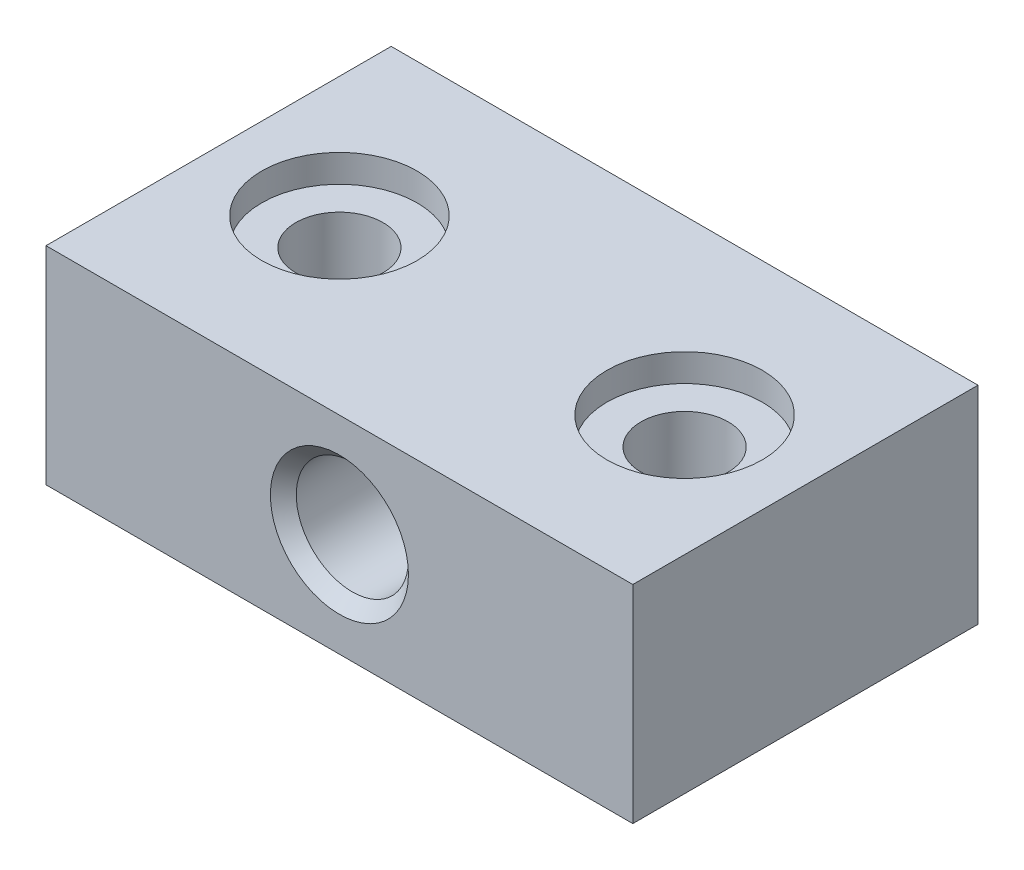
ISO-10303-21;
HEADER;
FILE_DESCRIPTION(('STEP AP214'),'2;1');
FILE_NAME('part.step','',(''),(''),'','','');
FILE_SCHEMA(('AUTOMOTIVE_DESIGN { 1 0 10303 214 1 1 1 1 }'));
ENDSEC;
DATA;
#1=APPLICATION_CONTEXT('core data for automotive mechanical design processes');
#2=APPLICATION_PROTOCOL_DEFINITION('international standard','automotive_design',2000,#1);
#3=PRODUCT_CONTEXT('',#1,'mechanical');
#4=PRODUCT('Part','Part','',(#3));
#5=PRODUCT_RELATED_PRODUCT_CATEGORY('part','',(#4));
#6=PRODUCT_DEFINITION_FORMATION('','',#4);
#7=PRODUCT_DEFINITION_CONTEXT('part definition',#1,'design');
#8=PRODUCT_DEFINITION('design','',#6,#7);
#9=PRODUCT_DEFINITION_SHAPE('','',#8);
#10=(LENGTH_UNIT() NAMED_UNIT(*) SI_UNIT(.MILLI.,.METRE.));
#11=(NAMED_UNIT(*) PLANE_ANGLE_UNIT() SI_UNIT($,.RADIAN.));
#12=(NAMED_UNIT(*) SI_UNIT($,.STERADIAN.) SOLID_ANGLE_UNIT());
#13=UNCERTAINTY_MEASURE_WITH_UNIT(LENGTH_MEASURE(1.E-05),#10,'distance_accuracy_value','');
#14=(GEOMETRIC_REPRESENTATION_CONTEXT(3) GLOBAL_UNCERTAINTY_ASSIGNED_CONTEXT((#13)) GLOBAL_UNIT_ASSIGNED_CONTEXT((#10,
#11,#12)) REPRESENTATION_CONTEXT('',''));
#15=CARTESIAN_POINT('',(0.,0.,0.));
#16=DIRECTION('',(0.,0.,1.));
#17=DIRECTION('',(1.,0.,0.));
#18=AXIS2_PLACEMENT_3D('',#15,#16,#17);
#19=CARTESIAN_POINT('',(-10.,-14.,-10.));
#20=DIRECTION('',(0.,1.,0.));
#21=DIRECTION('',(0.,0.,1.));
#22=AXIS2_PLACEMENT_3D('',#19,#20,#21);
#23=CYLINDRICAL_SURFACE('',#22,2.525);
#24=CARTESIAN_POINT('',(-10.,4.4,-10.));
#25=DIRECTION('',(0.,1.,0.));
#26=DIRECTION('',(0.,0.,1.));
#27=AXIS2_PLACEMENT_3D('',#24,#25,#26);
#28=CIRCLE('',#27,2.525);
#29=CARTESIAN_POINT('',(-10.,4.4,-7.475));
#30=VERTEX_POINT('',#29);
#31=EDGE_CURVE('E252',#30,#30,#28,.F.);
#32=ORIENTED_EDGE('',*,*,#31,.F.);
#33=EDGE_LOOP('',(#32));
#34=FACE_BOUND('',#33,.T.);
#35=CARTESIAN_POINT('',(-10.,-1.03,-10.));
#36=DIRECTION('',(0.,-1.,0.));
#37=DIRECTION('',(0.,0.,-1.));
#38=AXIS2_PLACEMENT_3D('',#35,#36,#37);
#39=CIRCLE('',#38,2.525);
#40=CARTESIAN_POINT('',(-10.,-1.03,-12.525));
#41=VERTEX_POINT('',#40);
#42=EDGE_CURVE('E194',#41,#41,#39,.F.);
#43=ORIENTED_EDGE('',*,*,#42,.F.);
#44=EDGE_LOOP('',(#43));
#45=FACE_BOUND('',#44,.T.);
#46=ADVANCED_FACE('F33',(#34,#45),#23,.F.);
#47=CARTESIAN_POINT('',(10.,-14.,-10.));
#48=DIRECTION('',(0.,1.,0.));
#49=DIRECTION('',(0.,0.,1.));
#50=AXIS2_PLACEMENT_3D('',#47,#48,#49);
#51=CYLINDRICAL_SURFACE('',#50,2.525);
#52=CARTESIAN_POINT('',(10.,4.4,-10.));
#53=DIRECTION('',(0.,1.,0.));
#54=DIRECTION('',(0.,0.,1.));
#55=AXIS2_PLACEMENT_3D('',#52,#53,#54);
#56=CIRCLE('',#55,2.525);
#57=CARTESIAN_POINT('',(10.,4.4,-7.475));
#58=VERTEX_POINT('',#57);
#59=EDGE_CURVE('E259',#58,#58,#56,.F.);
#60=ORIENTED_EDGE('',*,*,#59,.F.);
#61=EDGE_LOOP('',(#60));
#62=FACE_BOUND('',#61,.T.);
#63=CARTESIAN_POINT('',(10.,-1.03,-10.));
#64=DIRECTION('',(0.,-1.,0.));
#65=DIRECTION('',(0.,0.,-1.));
#66=AXIS2_PLACEMENT_3D('',#63,#64,#65);
#67=CIRCLE('',#66,2.525);
#68=CARTESIAN_POINT('',(10.,-1.03,-12.525));
#69=VERTEX_POINT('',#68);
#70=EDGE_CURVE('E239',#69,#69,#67,.F.);
#71=ORIENTED_EDGE('',*,*,#70,.F.);
#72=EDGE_LOOP('',(#71));
#73=FACE_BOUND('',#72,.T.);
#74=ADVANCED_FACE('F323',(#62,#73),#51,.F.);
#75=CARTESIAN_POINT('',(17.,6.,-20.));
#76=DIRECTION('',(1.,0.,0.));
#77=DIRECTION('',(0.,0.,-1.));
#78=AXIS2_PLACEMENT_3D('',#75,#76,#77);
#79=PLANE('',#78);
#80=DIRECTION('',(0.,1.,0.));
#81=VECTOR('',#80,1.);
#82=CARTESIAN_POINT('',(17.,6.,0.));
#83=LINE('',#82,#81);
#84=CARTESIAN_POINT('',(17.,-6.,0.));
#85=VERTEX_POINT('',#84);
#86=CARTESIAN_POINT('',(17.,6.,0.));
#87=VERTEX_POINT('',#86);
#88=EDGE_CURVE('E277',#85,#87,#83,.T.);
#89=ORIENTED_EDGE('',*,*,#88,.F.);
#90=DIRECTION('',(0.,0.,1.));
#91=VECTOR('',#90,1.);
#92=CARTESIAN_POINT('',(17.,-6.,-20.));
#93=LINE('',#92,#91);
#94=CARTESIAN_POINT('',(17.,-6.,-20.));
#95=VERTEX_POINT('',#94);
#96=EDGE_CURVE('E288',#95,#85,#93,.T.);
#97=ORIENTED_EDGE('',*,*,#96,.F.);
#98=DIRECTION('',(0.,1.,0.));
#99=VECTOR('',#98,1.);
#100=CARTESIAN_POINT('',(17.,6.,-20.));
#101=LINE('',#100,#99);
#102=CARTESIAN_POINT('',(17.,6.,-20.));
#103=VERTEX_POINT('',#102);
#104=EDGE_CURVE('E263',#95,#103,#101,.T.);
#105=ORIENTED_EDGE('',*,*,#104,.T.);
#106=DIRECTION('',(0.,0.,1.));
#107=VECTOR('',#106,1.);
#108=CARTESIAN_POINT('',(17.,6.,-20.));
#109=LINE('',#108,#107);
#110=EDGE_CURVE('E276',#103,#87,#109,.T.);
#111=ORIENTED_EDGE('',*,*,#110,.T.);
#112=EDGE_LOOP('',(#89,#97,#105,#111));
#113=FACE_BOUND('',#112,.T.);
#114=ADVANCED_FACE('F329',(#113),#79,.T.);
#115=CARTESIAN_POINT('',(-17.,-6.,-20.));
#116=DIRECTION('',(0.,-1.,0.));
#117=DIRECTION('',(0.,0.,-1.));
#118=AXIS2_PLACEMENT_3D('',#115,#116,#117);
#119=PLANE('',#118);
#120=DIRECTION('',(-0.866025403784439,0.,0.5));
#121=VECTOR('',#120,1.);
#122=CARTESIAN_POINT('',(-5.99896263451589,-6.,-7.69));
#123=LINE('',#122,#121);
#124=CARTESIAN_POINT('',(-5.99896263451589,-6.,-7.69));
#125=VERTEX_POINT('',#124);
#126=CARTESIAN_POINT('',(-10.,-6.,-5.38));
#127=VERTEX_POINT('',#126);
#128=EDGE_CURVE('E48',#125,#127,#123,.T.);
#129=ORIENTED_EDGE('',*,*,#128,.F.);
#130=DIRECTION('',(0.,0.,1.));
#131=VECTOR('',#130,1.);
#132=CARTESIAN_POINT('',(-5.99896263451589,-6.,-12.31));
#133=LINE('',#132,#131);
#134=CARTESIAN_POINT('',(-5.99896263451589,-6.,-12.31));
#135=VERTEX_POINT('',#134);
#136=EDGE_CURVE('E168',#135,#125,#133,.T.);
#137=ORIENTED_EDGE('',*,*,#136,.F.);
#138=DIRECTION('',(0.866025403784439,0.,0.5));
#139=VECTOR('',#138,1.);
#140=CARTESIAN_POINT('',(-10.,-6.,-14.62));
#141=LINE('',#140,#139);
#142=CARTESIAN_POINT('',(-10.,-6.,-14.62));
#143=VERTEX_POINT('',#142);
#144=EDGE_CURVE('E171',#143,#135,#141,.T.);
#145=ORIENTED_EDGE('',*,*,#144,.F.);
#146=DIRECTION('',(0.866025403784439,0.,-0.5));
#147=VECTOR('',#146,1.);
#148=CARTESIAN_POINT('',(-14.0010373654841,-6.,-12.31));
#149=LINE('',#148,#147);
#150=CARTESIAN_POINT('',(-14.0010373654841,-6.,-12.31));
#151=VERTEX_POINT('',#150);
#152=EDGE_CURVE('E187',#151,#143,#149,.T.);
#153=ORIENTED_EDGE('',*,*,#152,.F.);
#154=DIRECTION('',(0.,0.,-1.));
#155=VECTOR('',#154,1.);
#156=CARTESIAN_POINT('',(-14.0010373654841,-6.,-7.69));
#157=LINE('',#156,#155);
#158=CARTESIAN_POINT('',(-14.0010373654841,-6.,-7.69));
#159=VERTEX_POINT('',#158);
#160=EDGE_CURVE('E184',#159,#151,#157,.T.);
#161=ORIENTED_EDGE('',*,*,#160,.F.);
#162=DIRECTION('',(-0.866025403784439,0.,-0.5));
#163=VECTOR('',#162,1.);
#164=CARTESIAN_POINT('',(-10.,-6.,-5.38));
#165=LINE('',#164,#163);
#166=EDGE_CURVE('E182',#127,#159,#165,.T.);
#167=ORIENTED_EDGE('',*,*,#166,.F.);
#168=EDGE_LOOP('',(#129,#137,#145,#153,#161,#167));
#169=FACE_BOUND('',#168,.T.);
#170=DIRECTION('',(-0.866025403784438,0.,0.5));
#171=VECTOR('',#170,1.);
#172=CARTESIAN_POINT('',(14.0010373654841,-6.,-7.69));
#173=LINE('',#172,#171);
#174=CARTESIAN_POINT('',(14.0010373654841,-6.,-7.69));
#175=VERTEX_POINT('',#174);
#176=CARTESIAN_POINT('',(10.,-6.,-5.38));
#177=VERTEX_POINT('',#176);
#178=EDGE_CURVE('E56',#175,#177,#173,.T.);
#179=ORIENTED_EDGE('',*,*,#178,.F.);
#180=DIRECTION('',(0.,0.,1.));
#181=VECTOR('',#180,1.);
#182=CARTESIAN_POINT('',(14.0010373654841,-6.,-12.31));
#183=LINE('',#182,#181);
#184=CARTESIAN_POINT('',(14.0010373654841,-6.,-12.31));
#185=VERTEX_POINT('',#184);
#186=EDGE_CURVE('E206',#185,#175,#183,.T.);
#187=ORIENTED_EDGE('',*,*,#186,.F.);
#188=DIRECTION('',(0.866025403784439,0.,0.5));
#189=VECTOR('',#188,1.);
#190=CARTESIAN_POINT('',(10.,-6.,-14.62));
#191=LINE('',#190,#189);
#192=CARTESIAN_POINT('',(10.,-6.,-14.62));
#193=VERTEX_POINT('',#192);
#194=EDGE_CURVE('E232',#193,#185,#191,.T.);
#195=ORIENTED_EDGE('',*,*,#194,.F.);
#196=DIRECTION('',(0.866025403784439,0.,-0.5));
#197=VECTOR('',#196,1.);
#198=CARTESIAN_POINT('',(5.99896263451589,-6.,-12.31));
#199=LINE('',#198,#197);
#200=CARTESIAN_POINT('',(5.99896263451589,-6.,-12.31));
#201=VERTEX_POINT('',#200);
#202=EDGE_CURVE('E229',#201,#193,#199,.T.);
#203=ORIENTED_EDGE('',*,*,#202,.F.);
#204=DIRECTION('',(0.,0.,-1.));
#205=VECTOR('',#204,1.);
#206=CARTESIAN_POINT('',(5.99896263451589,-6.,-7.69));
#207=LINE('',#206,#205);
#208=CARTESIAN_POINT('',(5.99896263451589,-6.,-7.69));
#209=VERTEX_POINT('',#208);
#210=EDGE_CURVE('E226',#209,#201,#207,.T.);
#211=ORIENTED_EDGE('',*,*,#210,.F.);
#212=DIRECTION('',(-0.866025403784439,0.,-0.5));
#213=VECTOR('',#212,1.);
#214=CARTESIAN_POINT('',(10.,-6.,-5.38));
#215=LINE('',#214,#213);
#216=EDGE_CURVE('E223',#177,#209,#215,.T.);
#217=ORIENTED_EDGE('',*,*,#216,.F.);
#218=EDGE_LOOP('',(#179,#187,#195,#203,#211,#217));
#219=FACE_BOUND('',#218,.T.);
#220=DIRECTION('',(1.,0.,0.));
#221=VECTOR('',#220,1.);
#222=CARTESIAN_POINT('',(-17.,-6.,0.));
#223=LINE('',#222,#221);
#224=CARTESIAN_POINT('',(-17.,-6.,0.));
#225=VERTEX_POINT('',#224);
#226=EDGE_CURVE('E267',#225,#85,#223,.T.);
#227=ORIENTED_EDGE('',*,*,#226,.F.);
#228=DIRECTION('',(0.,0.,1.));
#229=VECTOR('',#228,1.);
#230=CARTESIAN_POINT('',(-17.,-6.,-20.));
#231=LINE('',#230,#229);
#232=CARTESIAN_POINT('',(-17.,-6.,-20.));
#233=VERTEX_POINT('',#232);
#234=EDGE_CURVE('E291',#233,#225,#231,.T.);
#235=ORIENTED_EDGE('',*,*,#234,.F.);
#236=DIRECTION('',(1.,0.,0.));
#237=VECTOR('',#236,1.);
#238=CARTESIAN_POINT('',(-17.,-6.,-20.));
#239=LINE('',#238,#237);
#240=EDGE_CURVE('E273',#233,#95,#239,.T.);
#241=ORIENTED_EDGE('',*,*,#240,.T.);
#242=ORIENTED_EDGE('',*,*,#96,.T.);
#243=EDGE_LOOP('',(#227,#235,#241,#242));
#244=FACE_BOUND('',#243,.T.);
#245=ADVANCED_FACE('F348',(#169,#219,#244),#119,.T.);
#246=CARTESIAN_POINT('',(-17.,6.,-20.));
#247=DIRECTION('',(-1.,0.,0.));
#248=DIRECTION('',(0.,0.,1.));
#249=AXIS2_PLACEMENT_3D('',#246,#247,#248);
#250=PLANE('',#249);
#251=DIRECTION('',(0.,-1.,0.));
#252=VECTOR('',#251,1.);
#253=CARTESIAN_POINT('',(-17.,6.,0.));
#254=LINE('',#253,#252);
#255=CARTESIAN_POINT('',(-17.,6.,0.));
#256=VERTEX_POINT('',#255);
#257=EDGE_CURVE('E283',#256,#225,#254,.T.);
#258=ORIENTED_EDGE('',*,*,#257,.F.);
#259=DIRECTION('',(0.,0.,1.));
#260=VECTOR('',#259,1.);
#261=CARTESIAN_POINT('',(-17.,6.,-20.));
#262=LINE('',#261,#260);
#263=CARTESIAN_POINT('',(-17.,6.,-20.));
#264=VERTEX_POINT('',#263);
#265=EDGE_CURVE('E293',#264,#256,#262,.T.);
#266=ORIENTED_EDGE('',*,*,#265,.F.);
#267=DIRECTION('',(0.,-1.,0.));
#268=VECTOR('',#267,1.);
#269=CARTESIAN_POINT('',(-17.,6.,-20.));
#270=LINE('',#269,#268);
#271=EDGE_CURVE('E270',#264,#233,#270,.T.);
#272=ORIENTED_EDGE('',*,*,#271,.T.);
#273=ORIENTED_EDGE('',*,*,#234,.T.);
#274=EDGE_LOOP('',(#258,#266,#272,#273));
#275=FACE_BOUND('',#274,.T.);
#276=ADVANCED_FACE('F351',(#275),#250,.T.);
#277=CARTESIAN_POINT('',(-17.,6.,-20.));
#278=DIRECTION('',(0.,1.,0.));
#279=DIRECTION('',(0.,0.,1.));
#280=AXIS2_PLACEMENT_3D('',#277,#278,#279);
#281=PLANE('',#280);
#282=CARTESIAN_POINT('',(-10.,6.,-10.));
#283=DIRECTION('',(0.,1.,0.));
#284=DIRECTION('',(0.,0.,1.));
#285=AXIS2_PLACEMENT_3D('',#282,#283,#284);
#286=CIRCLE('',#285,4.5);
#287=CARTESIAN_POINT('',(-10.,6.,-5.5));
#288=VERTEX_POINT('',#287);
#289=EDGE_CURVE('E253',#288,#288,#286,.T.);
#290=ORIENTED_EDGE('',*,*,#289,.F.);
#291=EDGE_LOOP('',(#290));
#292=FACE_BOUND('',#291,.T.);
#293=CARTESIAN_POINT('',(10.,6.,-10.));
#294=DIRECTION('',(0.,1.,0.));
#295=DIRECTION('',(0.,0.,1.));
#296=AXIS2_PLACEMENT_3D('',#293,#294,#295);
#297=CIRCLE('',#296,4.5);
#298=CARTESIAN_POINT('',(10.,6.,-5.5));
#299=VERTEX_POINT('',#298);
#300=EDGE_CURVE('E260',#299,#299,#297,.T.);
#301=ORIENTED_EDGE('',*,*,#300,.F.);
#302=EDGE_LOOP('',(#301));
#303=FACE_BOUND('',#302,.T.);
#304=DIRECTION('',(-1.,0.,0.));
#305=VECTOR('',#304,1.);
#306=CARTESIAN_POINT('',(-17.,6.,0.));
#307=LINE('',#306,#305);
#308=EDGE_CURVE('E280',#87,#256,#307,.T.);
#309=ORIENTED_EDGE('',*,*,#308,.F.);
#310=ORIENTED_EDGE('',*,*,#110,.F.);
#311=DIRECTION('',(-1.,0.,0.));
#312=VECTOR('',#311,1.);
#313=CARTESIAN_POINT('',(-17.,6.,-20.));
#314=LINE('',#313,#312);
#315=EDGE_CURVE('E266',#103,#264,#314,.T.);
#316=ORIENTED_EDGE('',*,*,#315,.T.);
#317=ORIENTED_EDGE('',*,*,#265,.T.);
#318=EDGE_LOOP('',(#309,#310,#316,#317));
#319=FACE_BOUND('',#318,.T.);
#320=ADVANCED_FACE('F343',(#292,#303,#319),#281,.T.);
#321=CARTESIAN_POINT('',(0.,0.,-20.));
#322=DIRECTION('',(0.,0.,1.));
#323=DIRECTION('',(1.,0.,0.));
#324=AXIS2_PLACEMENT_3D('',#321,#322,#323);
#325=PLANE('',#324);
#326=CARTESIAN_POINT('',(0.,0.,-20.));
#327=DIRECTION('',(0.,0.,1.));
#328=DIRECTION('',(1.,0.,0.));
#329=AXIS2_PLACEMENT_3D('',#326,#327,#328);
#330=CIRCLE('',#329,4.);
#331=CARTESIAN_POINT('',(4.,0.,-20.));
#332=VERTEX_POINT('',#331);
#333=EDGE_CURVE('E290',#332,#332,#330,.T.);
#334=ORIENTED_EDGE('',*,*,#333,.T.);
#335=EDGE_LOOP('',(#334));
#336=FACE_BOUND('',#335,.T.);
#337=ORIENTED_EDGE('',*,*,#104,.F.);
#338=ORIENTED_EDGE('',*,*,#240,.F.);
#339=ORIENTED_EDGE('',*,*,#271,.F.);
#340=ORIENTED_EDGE('',*,*,#315,.F.);
#341=EDGE_LOOP('',(#337,#338,#339,#340));
#342=FACE_BOUND('',#341,.T.);
#343=ADVANCED_FACE('F340',(#336,#342),#325,.F.);
#344=CARTESIAN_POINT('',(0.,0.,0.));
#345=DIRECTION('',(0.,0.,1.));
#346=DIRECTION('',(1.,0.,0.));
#347=AXIS2_PLACEMENT_3D('',#344,#345,#346);
#348=PLANE('',#347);
#349=CARTESIAN_POINT('',(0.,0.,0.));
#350=DIRECTION('',(0.,0.,1.));
#351=DIRECTION('',(1.,0.,0.));
#352=AXIS2_PLACEMENT_3D('',#349,#350,#351);
#353=CIRCLE('',#352,4.);
#354=CARTESIAN_POINT('',(4.,0.,0.));
#355=VERTEX_POINT('',#354);
#356=EDGE_CURVE('E11',#355,#355,#353,.F.);
#357=ORIENTED_EDGE('',*,*,#356,.T.);
#358=EDGE_LOOP('',(#357));
#359=FACE_BOUND('',#358,.T.);
#360=ORIENTED_EDGE('',*,*,#88,.T.);
#361=ORIENTED_EDGE('',*,*,#308,.T.);
#362=ORIENTED_EDGE('',*,*,#257,.T.);
#363=ORIENTED_EDGE('',*,*,#226,.T.);
#364=EDGE_LOOP('',(#360,#361,#362,#363));
#365=FACE_BOUND('',#364,.T.);
#366=ADVANCED_FACE('F339',(#359,#365),#348,.T.);
#367=CARTESIAN_POINT('',(0.,0.,-20.));
#368=DIRECTION('',(0.,0.,1.));
#369=DIRECTION('',(1.,0.,0.));
#370=AXIS2_PLACEMENT_3D('',#367,#368,#369);
#371=CYLINDRICAL_SURFACE('',#370,3.25);
#372=CARTESIAN_POINT('',(0.,0.,-0.749999999999994));
#373=DIRECTION('',(0.,0.,1.));
#374=DIRECTION('',(1.,0.,0.));
#375=AXIS2_PLACEMENT_3D('',#372,#373,#374);
#376=CIRCLE('',#375,3.25);
#377=CARTESIAN_POINT('',(3.25,0.,-0.749999999999994));
#378=VERTEX_POINT('',#377);
#379=EDGE_CURVE('E41',#378,#378,#376,.T.);
#380=ORIENTED_EDGE('',*,*,#379,.T.);
#381=EDGE_LOOP('',(#380));
#382=FACE_BOUND('',#381,.T.);
#383=CARTESIAN_POINT('',(0.,0.,-19.25));
#384=DIRECTION('',(0.,0.,1.));
#385=DIRECTION('',(1.,0.,0.));
#386=AXIS2_PLACEMENT_3D('',#383,#384,#385);
#387=CIRCLE('',#386,3.25);
#388=CARTESIAN_POINT('',(3.25,0.,-19.25));
#389=VERTEX_POINT('',#388);
#390=EDGE_CURVE('E306',#389,#389,#387,.F.);
#391=ORIENTED_EDGE('',*,*,#390,.T.);
#392=EDGE_LOOP('',(#391));
#393=FACE_BOUND('',#392,.T.);
#394=ADVANCED_FACE('F311',(#382,#393),#371,.F.);
#395=CARTESIAN_POINT('',(10.,4.4,-10.));
#396=DIRECTION('',(0.,1.,0.));
#397=DIRECTION('',(0.,0.,1.));
#398=AXIS2_PLACEMENT_3D('',#395,#396,#397);
#399=PLANE('',#398);
#400=CARTESIAN_POINT('',(10.,4.4,-10.));
#401=DIRECTION('',(0.,1.,0.));
#402=DIRECTION('',(0.,0.,1.));
#403=AXIS2_PLACEMENT_3D('',#400,#401,#402);
#404=CIRCLE('',#403,4.5);
#405=CARTESIAN_POINT('',(10.,4.4,-5.5));
#406=VERTEX_POINT('',#405);
#407=EDGE_CURVE('E256',#406,#406,#404,.T.);
#408=ORIENTED_EDGE('',*,*,#407,.T.);
#409=EDGE_LOOP('',(#408));
#410=FACE_BOUND('',#409,.T.);
#411=ORIENTED_EDGE('',*,*,#59,.T.);
#412=EDGE_LOOP('',(#411));
#413=FACE_BOUND('',#412,.T.);
#414=ADVANCED_FACE('F338',(#410,#413),#399,.T.);
#415=CARTESIAN_POINT('',(10.,4.4,-10.));
#416=DIRECTION('',(0.,1.,0.));
#417=DIRECTION('',(0.,0.,1.));
#418=AXIS2_PLACEMENT_3D('',#415,#416,#417);
#419=CYLINDRICAL_SURFACE('',#418,4.5);
#420=ORIENTED_EDGE('',*,*,#407,.F.);
#421=EDGE_LOOP('',(#420));
#422=FACE_BOUND('',#421,.T.);
#423=ORIENTED_EDGE('',*,*,#300,.T.);
#424=EDGE_LOOP('',(#423));
#425=FACE_BOUND('',#424,.T.);
#426=ADVANCED_FACE('F410',(#422,#425),#419,.F.);
#427=CARTESIAN_POINT('',(-10.,4.4,-10.));
#428=DIRECTION('',(0.,1.,0.));
#429=DIRECTION('',(0.,0.,1.));
#430=AXIS2_PLACEMENT_3D('',#427,#428,#429);
#431=PLANE('',#430);
#432=CARTESIAN_POINT('',(-10.,4.4,-10.));
#433=DIRECTION('',(0.,1.,0.));
#434=DIRECTION('',(0.,0.,1.));
#435=AXIS2_PLACEMENT_3D('',#432,#433,#434);
#436=CIRCLE('',#435,4.5);
#437=CARTESIAN_POINT('',(-10.,4.4,-5.5));
#438=VERTEX_POINT('',#437);
#439=EDGE_CURVE('E249',#438,#438,#436,.T.);
#440=ORIENTED_EDGE('',*,*,#439,.T.);
#441=EDGE_LOOP('',(#440));
#442=FACE_BOUND('',#441,.T.);
#443=ORIENTED_EDGE('',*,*,#31,.T.);
#444=EDGE_LOOP('',(#443));
#445=FACE_BOUND('',#444,.T.);
#446=ADVANCED_FACE('F418',(#442,#445),#431,.T.);
#447=CARTESIAN_POINT('',(-10.,4.4,-10.));
#448=DIRECTION('',(0.,1.,0.));
#449=DIRECTION('',(0.,0.,1.));
#450=AXIS2_PLACEMENT_3D('',#447,#448,#449);
#451=CYLINDRICAL_SURFACE('',#450,4.5);
#452=ORIENTED_EDGE('',*,*,#439,.F.);
#453=EDGE_LOOP('',(#452));
#454=FACE_BOUND('',#453,.T.);
#455=ORIENTED_EDGE('',*,*,#289,.T.);
#456=EDGE_LOOP('',(#455));
#457=FACE_BOUND('',#456,.T.);
#458=ADVANCED_FACE('F425',(#454,#457),#451,.F.);
#459=CARTESIAN_POINT('',(0.,-1.03,0.));
#460=DIRECTION('',(0.,-1.,0.));
#461=DIRECTION('',(0.,0.,-1.));
#462=AXIS2_PLACEMENT_3D('',#459,#460,#461);
#463=PLANE('',#462);
#464=DIRECTION('',(-0.866025403784438,0.,0.5));
#465=VECTOR('',#464,1.);
#466=CARTESIAN_POINT('',(14.0010373654841,-1.03,-7.69));
#467=LINE('',#466,#465);
#468=CARTESIAN_POINT('',(14.0010373654841,-1.03,-7.69));
#469=VERTEX_POINT('',#468);
#470=CARTESIAN_POINT('',(10.,-1.03,-5.38));
#471=VERTEX_POINT('',#470);
#472=EDGE_CURVE('E202',#469,#471,#467,.T.);
#473=ORIENTED_EDGE('',*,*,#472,.T.);
#474=DIRECTION('',(-0.866025403784439,0.,-0.5));
#475=VECTOR('',#474,1.);
#476=CARTESIAN_POINT('',(10.,-1.03,-5.38));
#477=LINE('',#476,#475);
#478=CARTESIAN_POINT('',(5.99896263451589,-1.03,-7.69));
#479=VERTEX_POINT('',#478);
#480=EDGE_CURVE('E205',#471,#479,#477,.T.);
#481=ORIENTED_EDGE('',*,*,#480,.T.);
#482=DIRECTION('',(0.,0.,-1.));
#483=VECTOR('',#482,1.);
#484=CARTESIAN_POINT('',(5.99896263451589,-1.03,-7.69));
#485=LINE('',#484,#483);
#486=CARTESIAN_POINT('',(5.99896263451589,-1.03,-12.31));
#487=VERTEX_POINT('',#486);
#488=EDGE_CURVE('E209',#479,#487,#485,.T.);
#489=ORIENTED_EDGE('',*,*,#488,.T.);
#490=DIRECTION('',(0.866025403784439,0.,-0.5));
#491=VECTOR('',#490,1.);
#492=CARTESIAN_POINT('',(5.99896263451589,-1.03,-12.31));
#493=LINE('',#492,#491);
#494=CARTESIAN_POINT('',(10.,-1.03,-14.62));
#495=VERTEX_POINT('',#494);
#496=EDGE_CURVE('E212',#487,#495,#493,.T.);
#497=ORIENTED_EDGE('',*,*,#496,.T.);
#498=DIRECTION('',(0.866025403784439,0.,0.5));
#499=VECTOR('',#498,1.);
#500=CARTESIAN_POINT('',(10.,-1.03,-14.62));
#501=LINE('',#500,#499);
#502=CARTESIAN_POINT('',(14.0010373654841,-1.03,-12.31));
#503=VERTEX_POINT('',#502);
#504=EDGE_CURVE('E215',#495,#503,#501,.T.);
#505=ORIENTED_EDGE('',*,*,#504,.T.);
#506=DIRECTION('',(0.,0.,1.));
#507=VECTOR('',#506,1.);
#508=CARTESIAN_POINT('',(14.0010373654841,-1.03,-12.31));
#509=LINE('',#508,#507);
#510=EDGE_CURVE('E218',#503,#469,#509,.T.);
#511=ORIENTED_EDGE('',*,*,#510,.T.);
#512=EDGE_LOOP('',(#473,#481,#489,#497,#505,#511));
#513=FACE_BOUND('',#512,.T.);
#514=ORIENTED_EDGE('',*,*,#70,.T.);
#515=EDGE_LOOP('',(#514));
#516=FACE_BOUND('',#515,.T.);
#517=ADVANCED_FACE('F433',(#513,#516),#463,.T.);
#518=CARTESIAN_POINT('',(14.0010373654841,-1.03,-7.69));
#519=DIRECTION('',(0.5,0.,0.866025403784438));
#520=DIRECTION('',(0.866025403784439,0.,-0.5));
#521=AXIS2_PLACEMENT_3D('',#518,#519,#520);
#522=PLANE('',#521);
#523=ORIENTED_EDGE('',*,*,#178,.T.);
#524=DIRECTION('',(0.,-1.,0.));
#525=VECTOR('',#524,1.);
#526=CARTESIAN_POINT('',(10.,-1.03,-5.38));
#527=LINE('',#526,#525);
#528=EDGE_CURVE('E221',#471,#177,#527,.T.);
#529=ORIENTED_EDGE('',*,*,#528,.F.);
#530=ORIENTED_EDGE('',*,*,#472,.F.);
#531=DIRECTION('',(0.,-1.,0.));
#532=VECTOR('',#531,1.);
#533=CARTESIAN_POINT('',(14.0010373654841,-1.03,-7.69));
#534=LINE('',#533,#532);
#535=EDGE_CURVE('E237',#469,#175,#534,.T.);
#536=ORIENTED_EDGE('',*,*,#535,.T.);
#537=EDGE_LOOP('',(#523,#529,#530,#536));
#538=FACE_BOUND('',#537,.T.);
#539=ADVANCED_FACE('F440',(#538),#522,.F.);
#540=CARTESIAN_POINT('',(14.0010373654841,-1.03,-12.31));
#541=DIRECTION('',(1.,0.,0.));
#542=DIRECTION('',(0.,0.,-1.));
#543=AXIS2_PLACEMENT_3D('',#540,#541,#542);
#544=PLANE('',#543);
#545=ORIENTED_EDGE('',*,*,#186,.T.);
#546=ORIENTED_EDGE('',*,*,#535,.F.);
#547=ORIENTED_EDGE('',*,*,#510,.F.);
#548=DIRECTION('',(0.,-1.,0.));
#549=VECTOR('',#548,1.);
#550=CARTESIAN_POINT('',(14.0010373654841,-1.03,-12.31));
#551=LINE('',#550,#549);
#552=EDGE_CURVE('E240',#503,#185,#551,.T.);
#553=ORIENTED_EDGE('',*,*,#552,.T.);
#554=EDGE_LOOP('',(#545,#546,#547,#553));
#555=FACE_BOUND('',#554,.T.);
#556=ADVANCED_FACE('F448',(#555),#544,.F.);
#557=CARTESIAN_POINT('',(10.,-1.03,-14.62));
#558=DIRECTION('',(0.5,0.,-0.866025403784439));
#559=DIRECTION('',(-0.866025403784439,0.,-0.5));
#560=AXIS2_PLACEMENT_3D('',#557,#558,#559);
#561=PLANE('',#560);
#562=ORIENTED_EDGE('',*,*,#194,.T.);
#563=ORIENTED_EDGE('',*,*,#552,.F.);
#564=ORIENTED_EDGE('',*,*,#504,.F.);
#565=DIRECTION('',(0.,-1.,0.));
#566=VECTOR('',#565,1.);
#567=CARTESIAN_POINT('',(10.,-1.03,-14.62));
#568=LINE('',#567,#566);
#569=EDGE_CURVE('E242',#495,#193,#568,.T.);
#570=ORIENTED_EDGE('',*,*,#569,.T.);
#571=EDGE_LOOP('',(#562,#563,#564,#570));
#572=FACE_BOUND('',#571,.T.);
#573=ADVANCED_FACE('F455',(#572),#561,.F.);
#574=CARTESIAN_POINT('',(5.99896263451589,-1.03,-12.31));
#575=DIRECTION('',(-0.5,0.,-0.866025403784439));
#576=DIRECTION('',(-0.866025403784439,0.,0.5));
#577=AXIS2_PLACEMENT_3D('',#574,#575,#576);
#578=PLANE('',#577);
#579=ORIENTED_EDGE('',*,*,#202,.T.);
#580=ORIENTED_EDGE('',*,*,#569,.F.);
#581=ORIENTED_EDGE('',*,*,#496,.F.);
#582=DIRECTION('',(0.,-1.,0.));
#583=VECTOR('',#582,1.);
#584=CARTESIAN_POINT('',(5.99896263451589,-1.03,-12.31));
#585=LINE('',#584,#583);
#586=EDGE_CURVE('E244',#487,#201,#585,.T.);
#587=ORIENTED_EDGE('',*,*,#586,.T.);
#588=EDGE_LOOP('',(#579,#580,#581,#587));
#589=FACE_BOUND('',#588,.T.);
#590=ADVANCED_FACE('F463',(#589),#578,.F.);
#591=CARTESIAN_POINT('',(5.99896263451589,-1.03,-7.69));
#592=DIRECTION('',(-1.,0.,0.));
#593=DIRECTION('',(0.,0.,1.));
#594=AXIS2_PLACEMENT_3D('',#591,#592,#593);
#595=PLANE('',#594);
#596=ORIENTED_EDGE('',*,*,#210,.T.);
#597=ORIENTED_EDGE('',*,*,#586,.F.);
#598=ORIENTED_EDGE('',*,*,#488,.F.);
#599=DIRECTION('',(0.,-1.,0.));
#600=VECTOR('',#599,1.);
#601=CARTESIAN_POINT('',(5.99896263451589,-1.03,-7.69));
#602=LINE('',#601,#600);
#603=EDGE_CURVE('E246',#479,#209,#602,.T.);
#604=ORIENTED_EDGE('',*,*,#603,.T.);
#605=EDGE_LOOP('',(#596,#597,#598,#604));
#606=FACE_BOUND('',#605,.T.);
#607=ADVANCED_FACE('F471',(#606),#595,.F.);
#608=CARTESIAN_POINT('',(10.,-1.03,-5.38));
#609=DIRECTION('',(-0.5,0.,0.866025403784439));
#610=DIRECTION('',(0.866025403784439,0.,0.5));
#611=AXIS2_PLACEMENT_3D('',#608,#609,#610);
#612=PLANE('',#611);
#613=ORIENTED_EDGE('',*,*,#216,.T.);
#614=ORIENTED_EDGE('',*,*,#603,.F.);
#615=ORIENTED_EDGE('',*,*,#480,.F.);
#616=ORIENTED_EDGE('',*,*,#528,.T.);
#617=EDGE_LOOP('',(#613,#614,#615,#616));
#618=FACE_BOUND('',#617,.T.);
#619=ADVANCED_FACE('F479',(#618),#612,.F.);
#620=CARTESIAN_POINT('',(0.,-1.03,0.));
#621=DIRECTION('',(0.,-1.,0.));
#622=DIRECTION('',(0.,0.,-1.));
#623=AXIS2_PLACEMENT_3D('',#620,#621,#622);
#624=PLANE('',#623);
#625=DIRECTION('',(-0.866025403784439,0.,0.5));
#626=VECTOR('',#625,1.);
#627=CARTESIAN_POINT('',(-5.99896263451589,-1.03,-7.69));
#628=LINE('',#627,#626);
#629=CARTESIAN_POINT('',(-5.99896263451589,-1.03,-7.69));
#630=VERTEX_POINT('',#629);
#631=CARTESIAN_POINT('',(-10.,-1.03,-5.38));
#632=VERTEX_POINT('',#631);
#633=EDGE_CURVE('E148',#630,#632,#628,.T.);
#634=ORIENTED_EDGE('',*,*,#633,.T.);
#635=DIRECTION('',(-0.866025403784439,0.,-0.5));
#636=VECTOR('',#635,1.);
#637=CARTESIAN_POINT('',(-10.,-1.03,-5.38));
#638=LINE('',#637,#636);
#639=CARTESIAN_POINT('',(-14.0010373654841,-1.03,-7.69));
#640=VERTEX_POINT('',#639);
#641=EDGE_CURVE('E157',#632,#640,#638,.T.);
#642=ORIENTED_EDGE('',*,*,#641,.T.);
#643=DIRECTION('',(0.,0.,-1.));
#644=VECTOR('',#643,1.);
#645=CARTESIAN_POINT('',(-14.0010373654841,-1.03,-7.69));
#646=LINE('',#645,#644);
#647=CARTESIAN_POINT('',(-14.0010373654841,-1.03,-12.31));
#648=VERTEX_POINT('',#647);
#649=EDGE_CURVE('E162',#640,#648,#646,.T.);
#650=ORIENTED_EDGE('',*,*,#649,.T.);
#651=DIRECTION('',(0.866025403784439,0.,-0.5));
#652=VECTOR('',#651,1.);
#653=CARTESIAN_POINT('',(-14.0010373654841,-1.03,-12.31));
#654=LINE('',#653,#652);
#655=CARTESIAN_POINT('',(-10.,-1.03,-14.62));
#656=VERTEX_POINT('',#655);
#657=EDGE_CURVE('E175',#648,#656,#654,.T.);
#658=ORIENTED_EDGE('',*,*,#657,.T.);
#659=DIRECTION('',(0.866025403784439,0.,0.5));
#660=VECTOR('',#659,1.);
#661=CARTESIAN_POINT('',(-10.,-1.03,-14.62));
#662=LINE('',#661,#660);
#663=CARTESIAN_POINT('',(-5.99896263451589,-1.03,-12.31));
#664=VERTEX_POINT('',#663);
#665=EDGE_CURVE('E178',#656,#664,#662,.T.);
#666=ORIENTED_EDGE('',*,*,#665,.T.);
#667=DIRECTION('',(0.,0.,1.));
#668=VECTOR('',#667,1.);
#669=CARTESIAN_POINT('',(-5.99896263451589,-1.03,-12.31));
#670=LINE('',#669,#668);
#671=EDGE_CURVE('E154',#664,#630,#670,.T.);
#672=ORIENTED_EDGE('',*,*,#671,.T.);
#673=EDGE_LOOP('',(#634,#642,#650,#658,#666,#672));
#674=FACE_BOUND('',#673,.T.);
#675=ORIENTED_EDGE('',*,*,#42,.T.);
#676=EDGE_LOOP('',(#675));
#677=FACE_BOUND('',#676,.T.);
#678=ADVANCED_FACE('F164',(#674,#677),#624,.T.);
#679=CARTESIAN_POINT('',(-5.99896263451589,-1.03,-7.69));
#680=DIRECTION('',(0.5,0.,0.866025403784438));
#681=DIRECTION('',(0.866025403784439,0.,-0.5));
#682=AXIS2_PLACEMENT_3D('',#679,#680,#681);
#683=PLANE('',#682);
#684=ORIENTED_EDGE('',*,*,#128,.T.);
#685=DIRECTION('',(0.,-1.,0.));
#686=VECTOR('',#685,1.);
#687=CARTESIAN_POINT('',(-10.,-1.03,-5.38));
#688=LINE('',#687,#686);
#689=EDGE_CURVE('E144',#632,#127,#688,.T.);
#690=ORIENTED_EDGE('',*,*,#689,.F.);
#691=ORIENTED_EDGE('',*,*,#633,.F.);
#692=DIRECTION('',(0.,-1.,0.));
#693=VECTOR('',#692,1.);
#694=CARTESIAN_POINT('',(-5.99896263451589,-1.03,-7.69));
#695=LINE('',#694,#693);
#696=EDGE_CURVE('E192',#630,#125,#695,.T.);
#697=ORIENTED_EDGE('',*,*,#696,.T.);
#698=EDGE_LOOP('',(#684,#690,#691,#697));
#699=FACE_BOUND('',#698,.T.);
#700=ADVANCED_FACE('F146',(#699),#683,.F.);
#701=CARTESIAN_POINT('',(-5.99896263451589,-1.03,-12.31));
#702=DIRECTION('',(1.,0.,0.));
#703=DIRECTION('',(0.,0.,-1.));
#704=AXIS2_PLACEMENT_3D('',#701,#702,#703);
#705=PLANE('',#704);
#706=ORIENTED_EDGE('',*,*,#136,.T.);
#707=ORIENTED_EDGE('',*,*,#696,.F.);
#708=ORIENTED_EDGE('',*,*,#671,.F.);
#709=DIRECTION('',(0.,-1.,0.));
#710=VECTOR('',#709,1.);
#711=CARTESIAN_POINT('',(-5.99896263451589,-1.03,-12.31));
#712=LINE('',#711,#710);
#713=EDGE_CURVE('E195',#664,#135,#712,.T.);
#714=ORIENTED_EDGE('',*,*,#713,.T.);
#715=EDGE_LOOP('',(#706,#707,#708,#714));
#716=FACE_BOUND('',#715,.T.);
#717=ADVANCED_FACE('F500',(#716),#705,.F.);
#718=CARTESIAN_POINT('',(-10.,-1.03,-14.62));
#719=DIRECTION('',(0.5,0.,-0.866025403784439));
#720=DIRECTION('',(-0.866025403784439,0.,-0.5));
#721=AXIS2_PLACEMENT_3D('',#718,#719,#720);
#722=PLANE('',#721);
#723=ORIENTED_EDGE('',*,*,#144,.T.);
#724=ORIENTED_EDGE('',*,*,#713,.F.);
#725=ORIENTED_EDGE('',*,*,#665,.F.);
#726=DIRECTION('',(0.,-1.,0.));
#727=VECTOR('',#726,1.);
#728=CARTESIAN_POINT('',(-10.,-1.03,-14.62));
#729=LINE('',#728,#727);
#730=EDGE_CURVE('E197',#656,#143,#729,.T.);
#731=ORIENTED_EDGE('',*,*,#730,.T.);
#732=EDGE_LOOP('',(#723,#724,#725,#731));
#733=FACE_BOUND('',#732,.T.);
#734=ADVANCED_FACE('F507',(#733),#722,.F.);
#735=CARTESIAN_POINT('',(-14.0010373654841,-1.03,-12.31));
#736=DIRECTION('',(-0.5,0.,-0.866025403784438));
#737=DIRECTION('',(-0.866025403784439,0.,0.5));
#738=AXIS2_PLACEMENT_3D('',#735,#736,#737);
#739=PLANE('',#738);
#740=ORIENTED_EDGE('',*,*,#152,.T.);
#741=ORIENTED_EDGE('',*,*,#730,.F.);
#742=ORIENTED_EDGE('',*,*,#657,.F.);
#743=DIRECTION('',(0.,-1.,0.));
#744=VECTOR('',#743,1.);
#745=CARTESIAN_POINT('',(-14.0010373654841,-1.03,-12.31));
#746=LINE('',#745,#744);
#747=EDGE_CURVE('E199',#648,#151,#746,.T.);
#748=ORIENTED_EDGE('',*,*,#747,.T.);
#749=EDGE_LOOP('',(#740,#741,#742,#748));
#750=FACE_BOUND('',#749,.T.);
#751=ADVANCED_FACE('F515',(#750),#739,.F.);
#752=CARTESIAN_POINT('',(-14.0010373654841,-1.03,-7.69));
#753=DIRECTION('',(-1.,0.,0.));
#754=DIRECTION('',(0.,0.,1.));
#755=AXIS2_PLACEMENT_3D('',#752,#753,#754);
#756=PLANE('',#755);
#757=ORIENTED_EDGE('',*,*,#160,.T.);
#758=ORIENTED_EDGE('',*,*,#747,.F.);
#759=ORIENTED_EDGE('',*,*,#649,.F.);
#760=DIRECTION('',(0.,-1.,0.));
#761=VECTOR('',#760,1.);
#762=CARTESIAN_POINT('',(-14.0010373654841,-1.03,-7.69));
#763=LINE('',#762,#761);
#764=EDGE_CURVE('E153',#640,#159,#763,.T.);
#765=ORIENTED_EDGE('',*,*,#764,.T.);
#766=EDGE_LOOP('',(#757,#758,#759,#765));
#767=FACE_BOUND('',#766,.T.);
#768=ADVANCED_FACE('F523',(#767),#756,.F.);
#769=CARTESIAN_POINT('',(-10.,-1.03,-5.38));
#770=DIRECTION('',(-0.5,0.,0.866025403784438));
#771=DIRECTION('',(0.866025403784439,0.,0.5));
#772=AXIS2_PLACEMENT_3D('',#769,#770,#771);
#773=PLANE('',#772);
#774=ORIENTED_EDGE('',*,*,#166,.T.);
#775=ORIENTED_EDGE('',*,*,#764,.F.);
#776=ORIENTED_EDGE('',*,*,#641,.F.);
#777=ORIENTED_EDGE('',*,*,#689,.T.);
#778=EDGE_LOOP('',(#774,#775,#776,#777));
#779=FACE_BOUND('',#778,.T.);
#780=ADVANCED_FACE('F158',(#779),#773,.F.);
#781=CARTESIAN_POINT('',(0.,0.,-20.));
#782=DIRECTION('',(0.,0.,-1.));
#783=DIRECTION('',(-1.,0.,0.));
#784=AXIS2_PLACEMENT_3D('',#781,#782,#783);
#785=CONICAL_SURFACE('',#784,4.,0.785398163397445);
#786=ORIENTED_EDGE('',*,*,#390,.F.);
#787=EDGE_LOOP('',(#786));
#788=FACE_BOUND('',#787,.T.);
#789=ORIENTED_EDGE('',*,*,#333,.F.);
#790=EDGE_LOOP('',(#789));
#791=FACE_BOUND('',#790,.T.);
#792=ADVANCED_FACE('F315',(#788,#791),#785,.F.);
#793=CARTESIAN_POINT('',(0.,0.,-0.749999999999994));
#794=DIRECTION('',(0.,0.,1.));
#795=DIRECTION('',(1.,0.,0.));
#796=AXIS2_PLACEMENT_3D('',#793,#794,#795);
#797=CONICAL_SURFACE('',#796,3.25,0.785398163397452);
#798=ORIENTED_EDGE('',*,*,#356,.F.);
#799=EDGE_LOOP('',(#798));
#800=FACE_BOUND('',#799,.T.);
#801=ORIENTED_EDGE('',*,*,#379,.F.);
#802=EDGE_LOOP('',(#801));
#803=FACE_BOUND('',#802,.T.);
#804=ADVANCED_FACE('F35',(#800,#803),#797,.F.);
#805=CLOSED_SHELL('',(#46,#74,#114,#245,#276,#320,#343,#366,#394,#414,#426,#446,#458,#517,#539,
#556,#573,#590,#607,#619,#678,#700,#717,#734,#751,#768,#780,#792,#804));
#806=MANIFOLD_SOLID_BREP('B2',#805);
#807=ADVANCED_BREP_SHAPE_REPRESENTATION('',(#18,#806),#14);
#808=SHAPE_DEFINITION_REPRESENTATION(#9,#807);
ENDSEC;
END-ISO-10303-21;
